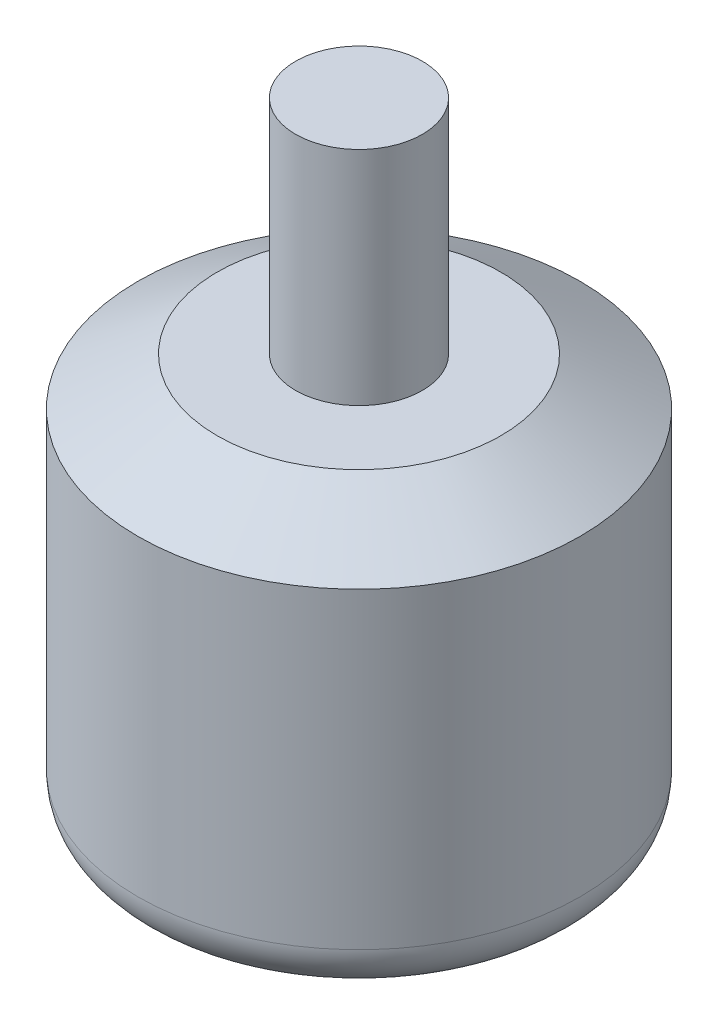
ISO-10303-21;
HEADER;
FILE_DESCRIPTION(('STEP AP214'),'2;1');
FILE_NAME('part.step','',(''),(''),'','','');
FILE_SCHEMA(('AUTOMOTIVE_DESIGN { 1 0 10303 214 1 1 1 1 }'));
ENDSEC;
DATA;
#1=APPLICATION_CONTEXT('core data for automotive mechanical design processes');
#2=APPLICATION_PROTOCOL_DEFINITION('international standard','automotive_design',2000,#1);
#3=PRODUCT_CONTEXT('',#1,'mechanical');
#4=PRODUCT('Part','Part','',(#3));
#5=PRODUCT_RELATED_PRODUCT_CATEGORY('part','',(#4));
#6=PRODUCT_DEFINITION_FORMATION('','',#4);
#7=PRODUCT_DEFINITION_CONTEXT('part definition',#1,'design');
#8=PRODUCT_DEFINITION('design','',#6,#7);
#9=PRODUCT_DEFINITION_SHAPE('','',#8);
#10=(LENGTH_UNIT() NAMED_UNIT(*) SI_UNIT(.MILLI.,.METRE.));
#11=(NAMED_UNIT(*) PLANE_ANGLE_UNIT() SI_UNIT($,.RADIAN.));
#12=(NAMED_UNIT(*) SI_UNIT($,.STERADIAN.) SOLID_ANGLE_UNIT());
#13=UNCERTAINTY_MEASURE_WITH_UNIT(LENGTH_MEASURE(1.E-05),#10,'distance_accuracy_value','');
#14=(GEOMETRIC_REPRESENTATION_CONTEXT(3) GLOBAL_UNCERTAINTY_ASSIGNED_CONTEXT((#13)) GLOBAL_UNIT_ASSIGNED_CONTEXT((#10,
#11,#12)) REPRESENTATION_CONTEXT('',''));
#15=CARTESIAN_POINT('',(0.,0.,0.));
#16=DIRECTION('',(0.,0.,1.));
#17=DIRECTION('',(1.,0.,0.));
#18=AXIS2_PLACEMENT_3D('',#15,#16,#17);
#19=CARTESIAN_POINT('',(0.,25.7,0.));
#20=DIRECTION('',(0.,-1.,0.));
#21=DIRECTION('',(0.,0.,-1.));
#22=AXIS2_PLACEMENT_3D('',#19,#20,#21);
#23=CYLINDRICAL_SURFACE('',#22,13.95);
#24=CARTESIAN_POINT('',(0.,3.,0.));
#25=DIRECTION('',(0.,1.,0.));
#26=DIRECTION('',(0.,0.,1.));
#27=AXIS2_PLACEMENT_3D('',#24,#25,#26);
#28=CIRCLE('',#27,13.95);
#29=CARTESIAN_POINT('',(0.,3.,13.95));
#30=VERTEX_POINT('',#29);
#31=EDGE_CURVE('E106',#30,#30,#28,.T.);
#32=ORIENTED_EDGE('',*,*,#31,.T.);
#33=EDGE_LOOP('',(#32));
#34=FACE_BOUND('',#33,.T.);
#35=CARTESIAN_POINT('',(0.,22.7,0.));
#36=DIRECTION('',(0.,1.,0.));
#37=DIRECTION('',(0.,0.,1.));
#38=AXIS2_PLACEMENT_3D('',#35,#36,#37);
#39=CIRCLE('',#38,13.95);
#40=CARTESIAN_POINT('',(0.,22.7,13.95));
#41=VERTEX_POINT('',#40);
#42=EDGE_CURVE('E103',#41,#41,#39,.F.);
#43=ORIENTED_EDGE('',*,*,#42,.T.);
#44=EDGE_LOOP('',(#43));
#45=FACE_BOUND('',#44,.T.);
#46=ADVANCED_FACE('F38',(#34,#45),#23,.T.);
#47=CARTESIAN_POINT('',(0.,25.7,0.));
#48=DIRECTION('',(0.,1.,0.));
#49=DIRECTION('',(0.,0.,1.));
#50=AXIS2_PLACEMENT_3D('',#47,#48,#49);
#51=PLANE('',#50);
#52=CARTESIAN_POINT('',(0.,25.7,0.));
#53=DIRECTION('',(0.,1.,0.));
#54=DIRECTION('',(0.,0.,1.));
#55=AXIS2_PLACEMENT_3D('',#52,#53,#54);
#56=CIRCLE('',#55,4.);
#57=CARTESIAN_POINT('',(0.,25.7,4.));
#58=VERTEX_POINT('',#57);
#59=EDGE_CURVE('E94',#58,#58,#56,.T.);
#60=ORIENTED_EDGE('',*,*,#59,.F.);
#61=EDGE_LOOP('',(#60));
#62=FACE_BOUND('',#61,.T.);
#63=CARTESIAN_POINT('',(0.,25.7,0.));
#64=DIRECTION('',(0.,1.,0.));
#65=DIRECTION('',(0.,0.,1.));
#66=AXIS2_PLACEMENT_3D('',#63,#64,#65);
#67=CIRCLE('',#66,8.94999999999999);
#68=CARTESIAN_POINT('',(0.,25.7,8.94999999999999));
#69=VERTEX_POINT('',#68);
#70=EDGE_CURVE('E98',#69,#69,#67,.T.);
#71=ORIENTED_EDGE('',*,*,#70,.T.);
#72=EDGE_LOOP('',(#71));
#73=FACE_BOUND('',#72,.T.);
#74=ADVANCED_FACE('F121',(#62,#73),#51,.T.);
#75=CARTESIAN_POINT('',(0.,0.,0.));
#76=DIRECTION('',(0.,1.,0.));
#77=DIRECTION('',(0.,0.,1.));
#78=AXIS2_PLACEMENT_3D('',#75,#76,#77);
#79=PLANE('',#78);
#80=CARTESIAN_POINT('',(0.,0.,0.));
#81=DIRECTION('',(0.,1.,0.));
#82=DIRECTION('',(0.,0.,1.));
#83=AXIS2_PLACEMENT_3D('',#80,#81,#82);
#84=CIRCLE('',#83,3.);
#85=CARTESIAN_POINT('',(0.,0.,3.));
#86=VERTEX_POINT('',#85);
#87=EDGE_CURVE('E11',#86,#86,#84,.F.);
#88=ORIENTED_EDGE('',*,*,#87,.F.);
#89=EDGE_LOOP('',(#88));
#90=FACE_BOUND('',#89,.T.);
#91=CARTESIAN_POINT('',(0.,0.,0.));
#92=DIRECTION('',(0.,1.,0.));
#93=DIRECTION('',(0.,0.,1.));
#94=AXIS2_PLACEMENT_3D('',#91,#92,#93);
#95=CIRCLE('',#94,10.95);
#96=CARTESIAN_POINT('',(0.,0.,10.95));
#97=VERTEX_POINT('',#96);
#98=EDGE_CURVE('E46',#97,#97,#95,.F.);
#99=ORIENTED_EDGE('',*,*,#98,.T.);
#100=EDGE_LOOP('',(#99));
#101=FACE_BOUND('',#100,.T.);
#102=CARTESIAN_POINT('',(0.,0.,-8.));
#103=DIRECTION('',(0.,-1.,0.));
#104=DIRECTION('',(0.,0.,-1.));
#105=AXIS2_PLACEMENT_3D('',#102,#103,#104);
#106=CIRCLE('',#105,1.24999999999999);
#107=CARTESIAN_POINT('',(0.,0.,-9.24999999999999));
#108=VERTEX_POINT('',#107);
#109=EDGE_CURVE('E70',#108,#108,#106,.T.);
#110=ORIENTED_EDGE('',*,*,#109,.F.);
#111=EDGE_LOOP('',(#110));
#112=FACE_BOUND('',#111,.T.);
#113=CARTESIAN_POINT('',(0.,0.,8.));
#114=DIRECTION('',(0.,-1.,0.));
#115=DIRECTION('',(0.,0.,-1.));
#116=AXIS2_PLACEMENT_3D('',#113,#114,#115);
#117=CIRCLE('',#116,1.24999999999999);
#118=CARTESIAN_POINT('',(0.,0.,6.75000000000001));
#119=VERTEX_POINT('',#118);
#120=EDGE_CURVE('E69',#119,#119,#117,.T.);
#121=ORIENTED_EDGE('',*,*,#120,.F.);
#122=EDGE_LOOP('',(#121));
#123=FACE_BOUND('',#122,.T.);
#124=CARTESIAN_POINT('',(9.5,0.,0.));
#125=DIRECTION('',(0.,-1.,0.));
#126=DIRECTION('',(0.,0.,-1.));
#127=AXIS2_PLACEMENT_3D('',#124,#125,#126);
#128=CIRCLE('',#127,1.24999999999999);
#129=CARTESIAN_POINT('',(9.5,0.,-1.24999999999999));
#130=VERTEX_POINT('',#129);
#131=EDGE_CURVE('E82',#130,#130,#128,.T.);
#132=ORIENTED_EDGE('',*,*,#131,.F.);
#133=EDGE_LOOP('',(#132));
#134=FACE_BOUND('',#133,.T.);
#135=CARTESIAN_POINT('',(-9.5,0.,0.));
#136=DIRECTION('',(0.,-1.,0.));
#137=DIRECTION('',(0.,0.,-1.));
#138=AXIS2_PLACEMENT_3D('',#135,#136,#137);
#139=CIRCLE('',#138,1.24999999999999);
#140=CARTESIAN_POINT('',(-9.5,0.,-1.24999999999999));
#141=VERTEX_POINT('',#140);
#142=EDGE_CURVE('E88',#141,#141,#139,.T.);
#143=ORIENTED_EDGE('',*,*,#142,.F.);
#144=EDGE_LOOP('',(#143));
#145=FACE_BOUND('',#144,.T.);
#146=ADVANCED_FACE('F111',(#90,#101,#112,#123,#134,#145),#79,.F.);
#147=CARTESIAN_POINT('',(0.,25.7,0.));
#148=DIRECTION('',(0.,-1.,0.));
#149=DIRECTION('',(0.,0.,-1.));
#150=AXIS2_PLACEMENT_3D('',#147,#148,#149);
#151=CONICAL_SURFACE('',#150,8.94999999999999,1.03037682652431);
#152=ORIENTED_EDGE('',*,*,#42,.F.);
#153=EDGE_LOOP('',(#152));
#154=FACE_BOUND('',#153,.T.);
#155=ORIENTED_EDGE('',*,*,#70,.F.);
#156=EDGE_LOOP('',(#155));
#157=FACE_BOUND('',#156,.T.);
#158=ADVANCED_FACE('F125',(#154,#157),#151,.T.);
#159=CARTESIAN_POINT('',(0.,39.7,0.));
#160=DIRECTION('',(0.,-1.,0.));
#161=DIRECTION('',(0.,0.,-1.));
#162=AXIS2_PLACEMENT_3D('',#159,#160,#161);
#163=CYLINDRICAL_SURFACE('',#162,4.);
#164=CARTESIAN_POINT('',(0.,39.7,0.));
#165=DIRECTION('',(0.,1.,0.));
#166=DIRECTION('',(0.,0.,1.));
#167=AXIS2_PLACEMENT_3D('',#164,#165,#166);
#168=CIRCLE('',#167,4.);
#169=CARTESIAN_POINT('',(0.,39.7,4.));
#170=VERTEX_POINT('',#169);
#171=EDGE_CURVE('E95',#170,#170,#168,.T.);
#172=ORIENTED_EDGE('',*,*,#171,.F.);
#173=EDGE_LOOP('',(#172));
#174=FACE_BOUND('',#173,.T.);
#175=ORIENTED_EDGE('',*,*,#59,.T.);
#176=EDGE_LOOP('',(#175));
#177=FACE_BOUND('',#176,.T.);
#178=ADVANCED_FACE('F128',(#174,#177),#163,.T.);
#179=CARTESIAN_POINT('',(0.,39.7,0.));
#180=DIRECTION('',(0.,1.,0.));
#181=DIRECTION('',(0.,0.,1.));
#182=AXIS2_PLACEMENT_3D('',#179,#180,#181);
#183=PLANE('',#182);
#184=ORIENTED_EDGE('',*,*,#171,.T.);
#185=EDGE_LOOP('',(#184));
#186=FACE_BOUND('',#185,.T.);
#187=ADVANCED_FACE('F143',(#186),#183,.T.);
#188=CARTESIAN_POINT('',(-9.5,7.50000000000001,0.));
#189=DIRECTION('',(0.,-1.,0.));
#190=DIRECTION('',(0.,0.,-1.));
#191=AXIS2_PLACEMENT_3D('',#188,#189,#190);
#192=CONICAL_SURFACE('',#191,1.24999999999999,1.02974425867665);
#193=CARTESIAN_POINT('',(-9.5,8.25107577378445,0.));
#194=VERTEX_POINT('',#193);
#195=VERTEX_LOOP('',#194);
#196=FACE_BOUND('',#195,.T.);
#197=CARTESIAN_POINT('',(-9.5,7.50000000000001,0.));
#198=DIRECTION('',(0.,-1.,0.));
#199=DIRECTION('',(0.,0.,-1.));
#200=AXIS2_PLACEMENT_3D('',#197,#198,#199);
#201=CIRCLE('',#200,1.24999999999999);
#202=CARTESIAN_POINT('',(-9.5,7.50000000000001,-1.24999999999999));
#203=VERTEX_POINT('',#202);
#204=EDGE_CURVE('E91',#203,#203,#201,.T.);
#205=ORIENTED_EDGE('',*,*,#204,.T.);
#206=EDGE_LOOP('',(#205));
#207=FACE_BOUND('',#206,.T.);
#208=ADVANCED_FACE('F147',(#196,#207),#192,.F.);
#209=CARTESIAN_POINT('',(-9.5,0.,0.));
#210=DIRECTION('',(0.,-1.,0.));
#211=DIRECTION('',(0.,0.,-1.));
#212=AXIS2_PLACEMENT_3D('',#209,#210,#211);
#213=CYLINDRICAL_SURFACE('',#212,1.24999999999999);
#214=ORIENTED_EDGE('',*,*,#204,.F.);
#215=EDGE_LOOP('',(#214));
#216=FACE_BOUND('',#215,.T.);
#217=ORIENTED_EDGE('',*,*,#142,.T.);
#218=EDGE_LOOP('',(#217));
#219=FACE_BOUND('',#218,.T.);
#220=ADVANCED_FACE('F151',(#216,#219),#213,.F.);
#221=CARTESIAN_POINT('',(9.5,7.50000000000001,0.));
#222=DIRECTION('',(0.,-1.,0.));
#223=DIRECTION('',(0.,0.,-1.));
#224=AXIS2_PLACEMENT_3D('',#221,#222,#223);
#225=CONICAL_SURFACE('',#224,1.24999999999999,1.02974425867665);
#226=CARTESIAN_POINT('',(9.5,8.25107577378445,0.));
#227=VERTEX_POINT('',#226);
#228=VERTEX_LOOP('',#227);
#229=FACE_BOUND('',#228,.T.);
#230=CARTESIAN_POINT('',(9.5,7.50000000000001,0.));
#231=DIRECTION('',(0.,-1.,0.));
#232=DIRECTION('',(0.,0.,-1.));
#233=AXIS2_PLACEMENT_3D('',#230,#231,#232);
#234=CIRCLE('',#233,1.24999999999999);
#235=CARTESIAN_POINT('',(9.5,7.50000000000001,-1.24999999999999));
#236=VERTEX_POINT('',#235);
#237=EDGE_CURVE('E85',#236,#236,#234,.T.);
#238=ORIENTED_EDGE('',*,*,#237,.T.);
#239=EDGE_LOOP('',(#238));
#240=FACE_BOUND('',#239,.T.);
#241=ADVANCED_FACE('F154',(#229,#240),#225,.F.);
#242=CARTESIAN_POINT('',(9.5,0.,0.));
#243=DIRECTION('',(0.,-1.,0.));
#244=DIRECTION('',(0.,0.,-1.));
#245=AXIS2_PLACEMENT_3D('',#242,#243,#244);
#246=CYLINDRICAL_SURFACE('',#245,1.24999999999999);
#247=ORIENTED_EDGE('',*,*,#237,.F.);
#248=EDGE_LOOP('',(#247));
#249=FACE_BOUND('',#248,.T.);
#250=ORIENTED_EDGE('',*,*,#131,.T.);
#251=EDGE_LOOP('',(#250));
#252=FACE_BOUND('',#251,.T.);
#253=ADVANCED_FACE('F158',(#249,#252),#246,.F.);
#254=CARTESIAN_POINT('',(0.,7.50000000000001,8.));
#255=DIRECTION('',(0.,-1.,0.));
#256=DIRECTION('',(0.,0.,-1.));
#257=AXIS2_PLACEMENT_3D('',#254,#255,#256);
#258=CONICAL_SURFACE('',#257,1.24999999999999,1.02974425867665);
#259=CARTESIAN_POINT('',(0.,8.25107577378445,8.));
#260=VERTEX_POINT('',#259);
#261=VERTEX_LOOP('',#260);
#262=FACE_BOUND('',#261,.T.);
#263=CARTESIAN_POINT('',(0.,7.50000000000001,8.));
#264=DIRECTION('',(0.,-1.,0.));
#265=DIRECTION('',(0.,0.,-1.));
#266=AXIS2_PLACEMENT_3D('',#263,#264,#265);
#267=CIRCLE('',#266,1.24999999999999);
#268=CARTESIAN_POINT('',(0.,7.50000000000001,6.75000000000001));
#269=VERTEX_POINT('',#268);
#270=EDGE_CURVE('E73',#269,#269,#267,.T.);
#271=ORIENTED_EDGE('',*,*,#270,.T.);
#272=EDGE_LOOP('',(#271));
#273=FACE_BOUND('',#272,.T.);
#274=ADVANCED_FACE('F161',(#262,#273),#258,.F.);
#275=CARTESIAN_POINT('',(0.,0.,8.));
#276=DIRECTION('',(0.,-1.,0.));
#277=DIRECTION('',(0.,0.,-1.));
#278=AXIS2_PLACEMENT_3D('',#275,#276,#277);
#279=CYLINDRICAL_SURFACE('',#278,1.24999999999999);
#280=ORIENTED_EDGE('',*,*,#270,.F.);
#281=EDGE_LOOP('',(#280));
#282=FACE_BOUND('',#281,.T.);
#283=ORIENTED_EDGE('',*,*,#120,.T.);
#284=EDGE_LOOP('',(#283));
#285=FACE_BOUND('',#284,.T.);
#286=ADVANCED_FACE('F63',(#282,#285),#279,.F.);
#287=CARTESIAN_POINT('',(0.,7.50000000000001,-8.));
#288=DIRECTION('',(0.,-1.,0.));
#289=DIRECTION('',(0.,0.,-1.));
#290=AXIS2_PLACEMENT_3D('',#287,#288,#289);
#291=CONICAL_SURFACE('',#290,1.24999999999999,1.02974425867665);
#292=CARTESIAN_POINT('',(0.,8.25107577378445,-8.));
#293=VERTEX_POINT('',#292);
#294=VERTEX_LOOP('',#293);
#295=FACE_BOUND('',#294,.T.);
#296=CARTESIAN_POINT('',(0.,7.50000000000001,-8.));
#297=DIRECTION('',(0.,-1.,0.));
#298=DIRECTION('',(0.,0.,-1.));
#299=AXIS2_PLACEMENT_3D('',#296,#297,#298);
#300=CIRCLE('',#299,1.24999999999999);
#301=CARTESIAN_POINT('',(0.,7.50000000000001,-9.24999999999999));
#302=VERTEX_POINT('',#301);
#303=EDGE_CURVE('E67',#302,#302,#300,.T.);
#304=ORIENTED_EDGE('',*,*,#303,.T.);
#305=EDGE_LOOP('',(#304));
#306=FACE_BOUND('',#305,.T.);
#307=ADVANCED_FACE('F59',(#295,#306),#291,.F.);
#308=CARTESIAN_POINT('',(0.,0.,-8.));
#309=DIRECTION('',(0.,-1.,0.));
#310=DIRECTION('',(0.,0.,-1.));
#311=AXIS2_PLACEMENT_3D('',#308,#309,#310);
#312=CYLINDRICAL_SURFACE('',#311,1.24999999999999);
#313=ORIENTED_EDGE('',*,*,#303,.F.);
#314=EDGE_LOOP('',(#313));
#315=FACE_BOUND('',#314,.T.);
#316=ORIENTED_EDGE('',*,*,#109,.T.);
#317=EDGE_LOOP('',(#316));
#318=FACE_BOUND('',#317,.T.);
#319=ADVANCED_FACE('F62',(#315,#318),#312,.F.);
#320=CARTESIAN_POINT('',(0.,3.,0.));
#321=DIRECTION('',(0.,1.,0.));
#322=DIRECTION('',(0.,0.,1.));
#323=AXIS2_PLACEMENT_3D('',#320,#321,#322);
#324=TOROIDAL_SURFACE('',#323,10.95,3.);
#325=ORIENTED_EDGE('',*,*,#98,.F.);
#326=EDGE_LOOP('',(#325));
#327=FACE_BOUND('',#326,.T.);
#328=ORIENTED_EDGE('',*,*,#31,.F.);
#329=EDGE_LOOP('',(#328));
#330=FACE_BOUND('',#329,.T.);
#331=ADVANCED_FACE('F40',(#327,#330),#324,.T.);
#332=CARTESIAN_POINT('',(0.,-2.5,0.));
#333=DIRECTION('',(0.,1.,0.));
#334=DIRECTION('',(0.,0.,1.));
#335=AXIS2_PLACEMENT_3D('',#332,#333,#334);
#336=CYLINDRICAL_SURFACE('',#335,3.);
#337=CARTESIAN_POINT('',(0.,-2.5,0.));
#338=DIRECTION('',(0.,-1.,0.));
#339=DIRECTION('',(0.,0.,-1.));
#340=AXIS2_PLACEMENT_3D('',#337,#338,#339);
#341=CIRCLE('',#340,3.);
#342=CARTESIAN_POINT('',(0.,-2.5,-3.));
#343=VERTEX_POINT('',#342);
#344=EDGE_CURVE('E76',#343,#343,#341,.T.);
#345=ORIENTED_EDGE('',*,*,#344,.F.);
#346=EDGE_LOOP('',(#345));
#347=FACE_BOUND('',#346,.T.);
#348=ORIENTED_EDGE('',*,*,#87,.T.);
#349=EDGE_LOOP('',(#348));
#350=FACE_BOUND('',#349,.T.);
#351=ADVANCED_FACE('F116',(#347,#350),#336,.T.);
#352=CARTESIAN_POINT('',(0.,-2.5,0.));
#353=DIRECTION('',(0.,-1.,0.));
#354=DIRECTION('',(0.,0.,-1.));
#355=AXIS2_PLACEMENT_3D('',#352,#353,#354);
#356=PLANE('',#355);
#357=ORIENTED_EDGE('',*,*,#344,.T.);
#358=EDGE_LOOP('',(#357));
#359=FACE_BOUND('',#358,.T.);
#360=ADVANCED_FACE('F173',(#359),#356,.T.);
#361=CLOSED_SHELL('',(#46,#74,#146,#158,#178,#187,#208,#220,#241,#253,#274,#286,#307,#319,#331,
#351,#360));
#362=MANIFOLD_SOLID_BREP('B2',#361);
#363=ADVANCED_BREP_SHAPE_REPRESENTATION('',(#18,#362),#14);
#364=SHAPE_DEFINITION_REPRESENTATION(#9,#363);
ENDSEC;
END-ISO-10303-21;
